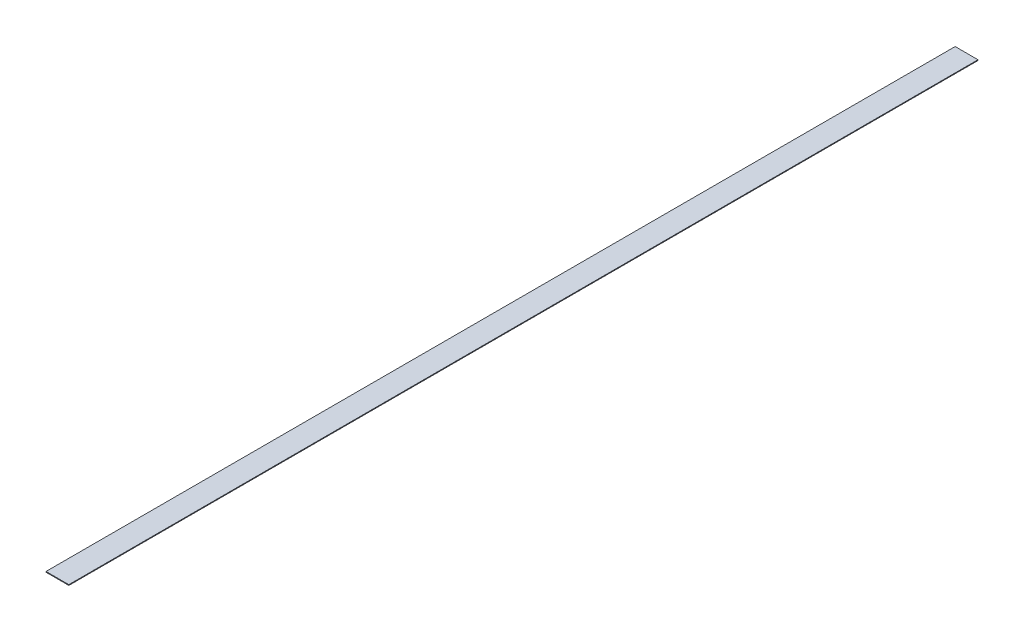
ISO-10303-21;
HEADER;
FILE_DESCRIPTION(('STEP AP214'),'2;1');
FILE_NAME('part.step','',(''),(''),'','','');
FILE_SCHEMA(('AUTOMOTIVE_DESIGN { 1 0 10303 214 1 1 1 1 }'));
ENDSEC;
DATA;
#1=APPLICATION_CONTEXT('core data for automotive mechanical design processes');
#2=APPLICATION_PROTOCOL_DEFINITION('international standard','automotive_design',2000,#1);
#3=PRODUCT_CONTEXT('',#1,'mechanical');
#4=PRODUCT('Part','Part','',(#3));
#5=PRODUCT_RELATED_PRODUCT_CATEGORY('part','',(#4));
#6=PRODUCT_DEFINITION_FORMATION('','',#4);
#7=PRODUCT_DEFINITION_CONTEXT('part definition',#1,'design');
#8=PRODUCT_DEFINITION('design','',#6,#7);
#9=PRODUCT_DEFINITION_SHAPE('','',#8);
#10=(LENGTH_UNIT() NAMED_UNIT(*) SI_UNIT(.MILLI.,.METRE.));
#11=(NAMED_UNIT(*) PLANE_ANGLE_UNIT() SI_UNIT($,.RADIAN.));
#12=(NAMED_UNIT(*) SI_UNIT($,.STERADIAN.) SOLID_ANGLE_UNIT());
#13=UNCERTAINTY_MEASURE_WITH_UNIT(LENGTH_MEASURE(1.E-05),#10,'distance_accuracy_value','');
#14=(GEOMETRIC_REPRESENTATION_CONTEXT(3) GLOBAL_UNCERTAINTY_ASSIGNED_CONTEXT((#13)) GLOBAL_UNIT_ASSIGNED_CONTEXT((#10,
#11,#12)) REPRESENTATION_CONTEXT('',''));
#15=CARTESIAN_POINT('',(0.,0.,0.));
#16=DIRECTION('',(0.,0.,1.));
#17=DIRECTION('',(1.,0.,0.));
#18=AXIS2_PLACEMENT_3D('',#15,#16,#17);
#19=CARTESIAN_POINT('',(25.4,1.5875,1011.2375));
#20=DIRECTION('',(-1.,0.,0.));
#21=DIRECTION('',(0.,0.,1.));
#22=AXIS2_PLACEMENT_3D('',#19,#20,#21);
#23=PLANE('',#22);
#24=DIRECTION('',(0.,0.,-1.));
#25=VECTOR('',#24,1.);
#26=CARTESIAN_POINT('',(25.4,0.,1011.2375));
#27=LINE('',#26,#25);
#28=CARTESIAN_POINT('',(25.4,0.,1011.2375));
#29=VERTEX_POINT('',#28);
#30=CARTESIAN_POINT('',(25.4,0.,-1011.2375));
#31=VERTEX_POINT('',#30);
#32=EDGE_CURVE('E100',#29,#31,#27,.T.);
#33=ORIENTED_EDGE('',*,*,#32,.T.);
#34=DIRECTION('',(0.,-1.,0.));
#35=VECTOR('',#34,1.);
#36=CARTESIAN_POINT('',(25.4,1.5875,-1011.2375));
#37=LINE('',#36,#35);
#38=CARTESIAN_POINT('',(25.4,1.5875,-1011.2375));
#39=VERTEX_POINT('',#38);
#40=EDGE_CURVE('E11',#39,#31,#37,.T.);
#41=ORIENTED_EDGE('',*,*,#40,.F.);
#42=DIRECTION('',(0.,0.,-1.));
#43=VECTOR('',#42,1.);
#44=CARTESIAN_POINT('',(25.4,1.5875,1011.2375));
#45=LINE('',#44,#43);
#46=CARTESIAN_POINT('',(25.4,1.5875,1011.2375));
#47=VERTEX_POINT('',#46);
#48=EDGE_CURVE('E88',#47,#39,#45,.T.);
#49=ORIENTED_EDGE('',*,*,#48,.F.);
#50=DIRECTION('',(0.,-1.,0.));
#51=VECTOR('',#50,1.);
#52=CARTESIAN_POINT('',(25.4,1.5875,1011.2375));
#53=LINE('',#52,#51);
#54=EDGE_CURVE('E96',#47,#29,#53,.T.);
#55=ORIENTED_EDGE('',*,*,#54,.T.);
#56=EDGE_LOOP('',(#33,#41,#49,#55));
#57=FACE_BOUND('',#56,.T.);
#58=ADVANCED_FACE('F37',(#57),#23,.F.);
#59=CARTESIAN_POINT('',(-25.4,1.5875,-1011.2375));
#60=DIRECTION('',(0.,0.,1.));
#61=DIRECTION('',(1.,0.,0.));
#62=AXIS2_PLACEMENT_3D('',#59,#60,#61);
#63=PLANE('',#62);
#64=DIRECTION('',(-1.,0.,0.));
#65=VECTOR('',#64,1.);
#66=CARTESIAN_POINT('',(-25.4,0.,-1011.2375));
#67=LINE('',#66,#65);
#68=CARTESIAN_POINT('',(-25.4,0.,-1011.2375));
#69=VERTEX_POINT('',#68);
#70=EDGE_CURVE('E92',#31,#69,#67,.T.);
#71=ORIENTED_EDGE('',*,*,#70,.T.);
#72=DIRECTION('',(0.,-1.,0.));
#73=VECTOR('',#72,1.);
#74=CARTESIAN_POINT('',(-25.4,1.5875,-1011.2375));
#75=LINE('',#74,#73);
#76=CARTESIAN_POINT('',(-25.4,1.5875,-1011.2375));
#77=VERTEX_POINT('',#76);
#78=EDGE_CURVE('E45',#77,#69,#75,.T.);
#79=ORIENTED_EDGE('',*,*,#78,.F.);
#80=DIRECTION('',(-1.,0.,0.));
#81=VECTOR('',#80,1.);
#82=CARTESIAN_POINT('',(-25.4,1.5875,-1011.2375));
#83=LINE('',#82,#81);
#84=EDGE_CURVE('E83',#39,#77,#83,.T.);
#85=ORIENTED_EDGE('',*,*,#84,.F.);
#86=ORIENTED_EDGE('',*,*,#40,.T.);
#87=EDGE_LOOP('',(#71,#79,#85,#86));
#88=FACE_BOUND('',#87,.T.);
#89=ADVANCED_FACE('F91',(#88),#63,.F.);
#90=CARTESIAN_POINT('',(-25.4,1.5875,1011.2375));
#91=DIRECTION('',(1.,0.,0.));
#92=DIRECTION('',(0.,0.,-1.));
#93=AXIS2_PLACEMENT_3D('',#90,#91,#92);
#94=PLANE('',#93);
#95=DIRECTION('',(0.,0.,1.));
#96=VECTOR('',#95,1.);
#97=CARTESIAN_POINT('',(-25.4,0.,1011.2375));
#98=LINE('',#97,#96);
#99=CARTESIAN_POINT('',(-25.4,0.,1011.2375));
#100=VERTEX_POINT('',#99);
#101=EDGE_CURVE('E70',#69,#100,#98,.T.);
#102=ORIENTED_EDGE('',*,*,#101,.T.);
#103=DIRECTION('',(0.,-1.,0.));
#104=VECTOR('',#103,1.);
#105=CARTESIAN_POINT('',(-25.4,1.5875,1011.2375));
#106=LINE('',#105,#104);
#107=CARTESIAN_POINT('',(-25.4,1.5875,1011.2375));
#108=VERTEX_POINT('',#107);
#109=EDGE_CURVE('E93',#108,#100,#106,.T.);
#110=ORIENTED_EDGE('',*,*,#109,.F.);
#111=DIRECTION('',(0.,0.,1.));
#112=VECTOR('',#111,1.);
#113=CARTESIAN_POINT('',(-25.4,1.5875,1011.2375));
#114=LINE('',#113,#112);
#115=EDGE_CURVE('E86',#77,#108,#114,.T.);
#116=ORIENTED_EDGE('',*,*,#115,.F.);
#117=ORIENTED_EDGE('',*,*,#78,.T.);
#118=EDGE_LOOP('',(#102,#110,#116,#117));
#119=FACE_BOUND('',#118,.T.);
#120=ADVANCED_FACE('F94',(#119),#94,.F.);
#121=CARTESIAN_POINT('',(-25.4,1.5875,1011.2375));
#122=DIRECTION('',(0.,0.,-1.));
#123=DIRECTION('',(-1.,0.,0.));
#124=AXIS2_PLACEMENT_3D('',#121,#122,#123);
#125=PLANE('',#124);
#126=DIRECTION('',(1.,0.,0.));
#127=VECTOR('',#126,1.);
#128=CARTESIAN_POINT('',(-25.4,0.,1011.2375));
#129=LINE('',#128,#127);
#130=EDGE_CURVE('E76',#100,#29,#129,.T.);
#131=ORIENTED_EDGE('',*,*,#130,.T.);
#132=ORIENTED_EDGE('',*,*,#54,.F.);
#133=DIRECTION('',(1.,0.,0.));
#134=VECTOR('',#133,1.);
#135=CARTESIAN_POINT('',(-25.4,1.5875,1011.2375));
#136=LINE('',#135,#134);
#137=EDGE_CURVE('E53',#108,#47,#136,.T.);
#138=ORIENTED_EDGE('',*,*,#137,.F.);
#139=ORIENTED_EDGE('',*,*,#109,.T.);
#140=EDGE_LOOP('',(#131,#132,#138,#139));
#141=FACE_BOUND('',#140,.T.);
#142=ADVANCED_FACE('F107',(#141),#125,.F.);
#143=CARTESIAN_POINT('',(0.,1.5875,0.));
#144=DIRECTION('',(0.,-1.,0.));
#145=DIRECTION('',(0.,0.,-1.));
#146=AXIS2_PLACEMENT_3D('',#143,#144,#145);
#147=PLANE('',#146);
#148=ORIENTED_EDGE('',*,*,#48,.T.);
#149=ORIENTED_EDGE('',*,*,#84,.T.);
#150=ORIENTED_EDGE('',*,*,#115,.T.);
#151=ORIENTED_EDGE('',*,*,#137,.T.);
#152=EDGE_LOOP('',(#148,#149,#150,#151));
#153=FACE_BOUND('',#152,.T.);
#154=ADVANCED_FACE('F84',(#153),#147,.F.);
#155=CARTESIAN_POINT('',(0.,0.,0.));
#156=DIRECTION('',(0.,-1.,0.));
#157=DIRECTION('',(0.,0.,-1.));
#158=AXIS2_PLACEMENT_3D('',#155,#156,#157);
#159=PLANE('',#158);
#160=ORIENTED_EDGE('',*,*,#32,.F.);
#161=ORIENTED_EDGE('',*,*,#130,.F.);
#162=ORIENTED_EDGE('',*,*,#101,.F.);
#163=ORIENTED_EDGE('',*,*,#70,.F.);
#164=EDGE_LOOP('',(#160,#161,#162,#163));
#165=FACE_BOUND('',#164,.T.);
#166=ADVANCED_FACE('F110',(#165),#159,.T.);
#167=CLOSED_SHELL('',(#58,#89,#120,#142,#154,#166));
#168=MANIFOLD_SOLID_BREP('B2',#167);
#169=ADVANCED_BREP_SHAPE_REPRESENTATION('',(#18,#168),#14);
#170=SHAPE_DEFINITION_REPRESENTATION(#9,#169);
ENDSEC;
END-ISO-10303-21;
